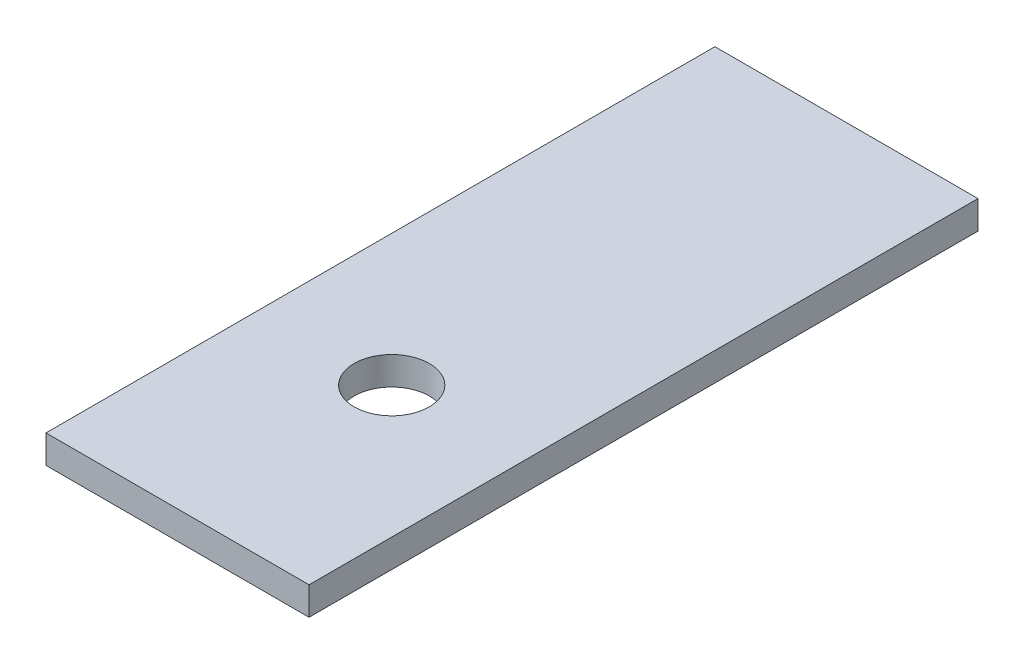
ISO-10303-21;
HEADER;
FILE_DESCRIPTION(('STEP AP214'),'2;1');
FILE_NAME('part.step','',(''),(''),'','','');
FILE_SCHEMA(('AUTOMOTIVE_DESIGN { 1 0 10303 214 1 1 1 1 }'));
ENDSEC;
DATA;
#1=APPLICATION_CONTEXT('core data for automotive mechanical design processes');
#2=APPLICATION_PROTOCOL_DEFINITION('international standard','automotive_design',2000,#1);
#3=PRODUCT_CONTEXT('',#1,'mechanical');
#4=PRODUCT('Part','Part','',(#3));
#5=PRODUCT_RELATED_PRODUCT_CATEGORY('part','',(#4));
#6=PRODUCT_DEFINITION_FORMATION('','',#4);
#7=PRODUCT_DEFINITION_CONTEXT('part definition',#1,'design');
#8=PRODUCT_DEFINITION('design','',#6,#7);
#9=PRODUCT_DEFINITION_SHAPE('','',#8);
#10=(LENGTH_UNIT() NAMED_UNIT(*) SI_UNIT(.MILLI.,.METRE.));
#11=(NAMED_UNIT(*) PLANE_ANGLE_UNIT() SI_UNIT($,.RADIAN.));
#12=(NAMED_UNIT(*) SI_UNIT($,.STERADIAN.) SOLID_ANGLE_UNIT());
#13=UNCERTAINTY_MEASURE_WITH_UNIT(LENGTH_MEASURE(1.E-05),#10,'distance_accuracy_value','');
#14=(GEOMETRIC_REPRESENTATION_CONTEXT(3) GLOBAL_UNCERTAINTY_ASSIGNED_CONTEXT((#13)) GLOBAL_UNIT_ASSIGNED_CONTEXT((#10,
#11,#12)) REPRESENTATION_CONTEXT('',''));
#15=CARTESIAN_POINT('',(0.,0.,0.));
#16=DIRECTION('',(0.,0.,1.));
#17=DIRECTION('',(1.,0.,0.));
#18=AXIS2_PLACEMENT_3D('',#15,#16,#17);
#19=CARTESIAN_POINT('',(14.,3.,35.6));
#20=DIRECTION('',(-1.,0.,0.));
#21=DIRECTION('',(0.,0.,1.));
#22=AXIS2_PLACEMENT_3D('',#19,#20,#21);
#23=PLANE('',#22);
#24=DIRECTION('',(0.,0.,-1.));
#25=VECTOR('',#24,1.);
#26=CARTESIAN_POINT('',(14.,0.,35.6));
#27=LINE('',#26,#25);
#28=CARTESIAN_POINT('',(14.,0.,35.6));
#29=VERTEX_POINT('',#28);
#30=CARTESIAN_POINT('',(14.,0.,-35.6));
#31=VERTEX_POINT('',#30);
#32=EDGE_CURVE('E103',#29,#31,#27,.T.);
#33=ORIENTED_EDGE('',*,*,#32,.T.);
#34=DIRECTION('',(0.,-1.,0.));
#35=VECTOR('',#34,1.);
#36=CARTESIAN_POINT('',(14.,3.,-35.6));
#37=LINE('',#36,#35);
#38=CARTESIAN_POINT('',(14.,3.,-35.6));
#39=VERTEX_POINT('',#38);
#40=EDGE_CURVE('E11',#39,#31,#37,.T.);
#41=ORIENTED_EDGE('',*,*,#40,.F.);
#42=DIRECTION('',(0.,0.,-1.));
#43=VECTOR('',#42,1.);
#44=CARTESIAN_POINT('',(14.,3.,35.6));
#45=LINE('',#44,#43);
#46=CARTESIAN_POINT('',(14.,3.,35.6));
#47=VERTEX_POINT('',#46);
#48=EDGE_CURVE('E90',#47,#39,#45,.T.);
#49=ORIENTED_EDGE('',*,*,#48,.F.);
#50=DIRECTION('',(0.,-1.,0.));
#51=VECTOR('',#50,1.);
#52=CARTESIAN_POINT('',(14.,3.,35.6));
#53=LINE('',#52,#51);
#54=EDGE_CURVE('E99',#47,#29,#53,.T.);
#55=ORIENTED_EDGE('',*,*,#54,.T.);
#56=EDGE_LOOP('',(#33,#41,#49,#55));
#57=FACE_BOUND('',#56,.T.);
#58=ADVANCED_FACE('F38',(#57),#23,.F.);
#59=CARTESIAN_POINT('',(-14.,3.,-35.6));
#60=DIRECTION('',(0.,0.,1.));
#61=DIRECTION('',(1.,0.,0.));
#62=AXIS2_PLACEMENT_3D('',#59,#60,#61);
#63=PLANE('',#62);
#64=DIRECTION('',(-1.,0.,0.));
#65=VECTOR('',#64,1.);
#66=CARTESIAN_POINT('',(-14.,0.,-35.6));
#67=LINE('',#66,#65);
#68=CARTESIAN_POINT('',(-14.,0.,-35.6));
#69=VERTEX_POINT('',#68);
#70=EDGE_CURVE('E94',#31,#69,#67,.T.);
#71=ORIENTED_EDGE('',*,*,#70,.T.);
#72=DIRECTION('',(0.,-1.,0.));
#73=VECTOR('',#72,1.);
#74=CARTESIAN_POINT('',(-14.,3.,-35.6));
#75=LINE('',#74,#73);
#76=CARTESIAN_POINT('',(-14.,3.,-35.6));
#77=VERTEX_POINT('',#76);
#78=EDGE_CURVE('E47',#77,#69,#75,.T.);
#79=ORIENTED_EDGE('',*,*,#78,.F.);
#80=DIRECTION('',(-1.,0.,0.));
#81=VECTOR('',#80,1.);
#82=CARTESIAN_POINT('',(-14.,3.,-35.6));
#83=LINE('',#82,#81);
#84=EDGE_CURVE('E85',#39,#77,#83,.T.);
#85=ORIENTED_EDGE('',*,*,#84,.F.);
#86=ORIENTED_EDGE('',*,*,#40,.T.);
#87=EDGE_LOOP('',(#71,#79,#85,#86));
#88=FACE_BOUND('',#87,.T.);
#89=ADVANCED_FACE('F93',(#88),#63,.F.);
#90=CARTESIAN_POINT('',(-14.,3.,35.6));
#91=DIRECTION('',(1.,0.,0.));
#92=DIRECTION('',(0.,0.,-1.));
#93=AXIS2_PLACEMENT_3D('',#90,#91,#92);
#94=PLANE('',#93);
#95=DIRECTION('',(0.,0.,1.));
#96=VECTOR('',#95,1.);
#97=CARTESIAN_POINT('',(-14.,0.,35.6));
#98=LINE('',#97,#96);
#99=CARTESIAN_POINT('',(-14.,0.,35.6));
#100=VERTEX_POINT('',#99);
#101=EDGE_CURVE('E72',#69,#100,#98,.T.);
#102=ORIENTED_EDGE('',*,*,#101,.T.);
#103=DIRECTION('',(0.,-1.,0.));
#104=VECTOR('',#103,1.);
#105=CARTESIAN_POINT('',(-14.,3.,35.6));
#106=LINE('',#105,#104);
#107=CARTESIAN_POINT('',(-14.,3.,35.6));
#108=VERTEX_POINT('',#107);
#109=EDGE_CURVE('E95',#108,#100,#106,.T.);
#110=ORIENTED_EDGE('',*,*,#109,.F.);
#111=DIRECTION('',(0.,0.,1.));
#112=VECTOR('',#111,1.);
#113=CARTESIAN_POINT('',(-14.,3.,35.6));
#114=LINE('',#113,#112);
#115=EDGE_CURVE('E88',#77,#108,#114,.T.);
#116=ORIENTED_EDGE('',*,*,#115,.F.);
#117=ORIENTED_EDGE('',*,*,#78,.T.);
#118=EDGE_LOOP('',(#102,#110,#116,#117));
#119=FACE_BOUND('',#118,.T.);
#120=ADVANCED_FACE('F97',(#119),#94,.F.);
#121=CARTESIAN_POINT('',(-14.,3.,35.6));
#122=DIRECTION('',(0.,0.,-1.));
#123=DIRECTION('',(-1.,0.,0.));
#124=AXIS2_PLACEMENT_3D('',#121,#122,#123);
#125=PLANE('',#124);
#126=DIRECTION('',(1.,0.,0.));
#127=VECTOR('',#126,1.);
#128=CARTESIAN_POINT('',(-14.,0.,35.6));
#129=LINE('',#128,#127);
#130=EDGE_CURVE('E78',#100,#29,#129,.T.);
#131=ORIENTED_EDGE('',*,*,#130,.T.);
#132=ORIENTED_EDGE('',*,*,#54,.F.);
#133=DIRECTION('',(1.,0.,0.));
#134=VECTOR('',#133,1.);
#135=CARTESIAN_POINT('',(-14.,3.,35.6));
#136=LINE('',#135,#134);
#137=EDGE_CURVE('E55',#108,#47,#136,.T.);
#138=ORIENTED_EDGE('',*,*,#137,.F.);
#139=ORIENTED_EDGE('',*,*,#109,.T.);
#140=EDGE_LOOP('',(#131,#132,#138,#139));
#141=FACE_BOUND('',#140,.T.);
#142=ADVANCED_FACE('F110',(#141),#125,.F.);
#143=CARTESIAN_POINT('',(0.,3.,0.));
#144=DIRECTION('',(0.,-1.,0.));
#145=DIRECTION('',(0.,0.,-1.));
#146=AXIS2_PLACEMENT_3D('',#143,#144,#145);
#147=PLANE('',#146);
#148=CARTESIAN_POINT('',(0.,3.,12.7999999999985));
#149=DIRECTION('',(0.,1.,0.));
#150=DIRECTION('',(0.,0.,1.));
#151=AXIS2_PLACEMENT_3D('',#148,#149,#150);
#152=CIRCLE('',#151,4.);
#153=CARTESIAN_POINT('',(0.,3.,16.7999999999985));
#154=VERTEX_POINT('',#153);
#155=EDGE_CURVE('E116',#154,#154,#152,.T.);
#156=ORIENTED_EDGE('',*,*,#155,.F.);
#157=EDGE_LOOP('',(#156));
#158=FACE_BOUND('',#157,.T.);
#159=ORIENTED_EDGE('',*,*,#48,.T.);
#160=ORIENTED_EDGE('',*,*,#84,.T.);
#161=ORIENTED_EDGE('',*,*,#115,.T.);
#162=ORIENTED_EDGE('',*,*,#137,.T.);
#163=EDGE_LOOP('',(#159,#160,#161,#162));
#164=FACE_BOUND('',#163,.T.);
#165=ADVANCED_FACE('F86',(#158,#164),#147,.F.);
#166=CARTESIAN_POINT('',(0.,0.,0.));
#167=DIRECTION('',(0.,-1.,0.));
#168=DIRECTION('',(0.,0.,-1.));
#169=AXIS2_PLACEMENT_3D('',#166,#167,#168);
#170=PLANE('',#169);
#171=CARTESIAN_POINT('',(0.,0.,12.7999999999985));
#172=DIRECTION('',(0.,-1.,0.));
#173=DIRECTION('',(0.,0.,-1.));
#174=AXIS2_PLACEMENT_3D('',#171,#172,#173);
#175=CIRCLE('',#174,4.);
#176=CARTESIAN_POINT('',(0.,0.,8.79999999999852));
#177=VERTEX_POINT('',#176);
#178=EDGE_CURVE('E41',#177,#177,#175,.T.);
#179=ORIENTED_EDGE('',*,*,#178,.F.);
#180=EDGE_LOOP('',(#179));
#181=FACE_BOUND('',#180,.T.);
#182=ORIENTED_EDGE('',*,*,#32,.F.);
#183=ORIENTED_EDGE('',*,*,#130,.F.);
#184=ORIENTED_EDGE('',*,*,#101,.F.);
#185=ORIENTED_EDGE('',*,*,#70,.F.);
#186=EDGE_LOOP('',(#182,#183,#184,#185));
#187=FACE_BOUND('',#186,.T.);
#188=ADVANCED_FACE('F113',(#181,#187),#170,.T.);
#189=CARTESIAN_POINT('',(0.,-7.,12.7999999999985));
#190=DIRECTION('',(0.,1.,0.));
#191=DIRECTION('',(0.,0.,1.));
#192=AXIS2_PLACEMENT_3D('',#189,#190,#191);
#193=CYLINDRICAL_SURFACE('',#192,4.);
#194=ORIENTED_EDGE('',*,*,#178,.T.);
#195=EDGE_LOOP('',(#194));
#196=FACE_BOUND('',#195,.T.);
#197=ORIENTED_EDGE('',*,*,#155,.T.);
#198=EDGE_LOOP('',(#197));
#199=FACE_BOUND('',#198,.T.);
#200=ADVANCED_FACE('F123',(#196,#199),#193,.F.);
#201=CLOSED_SHELL('',(#58,#89,#120,#142,#165,#188,#200));
#202=MANIFOLD_SOLID_BREP('B2',#201);
#203=ADVANCED_BREP_SHAPE_REPRESENTATION('',(#18,#202),#14);
#204=SHAPE_DEFINITION_REPRESENTATION(#9,#203);
ENDSEC;
END-ISO-10303-21;
